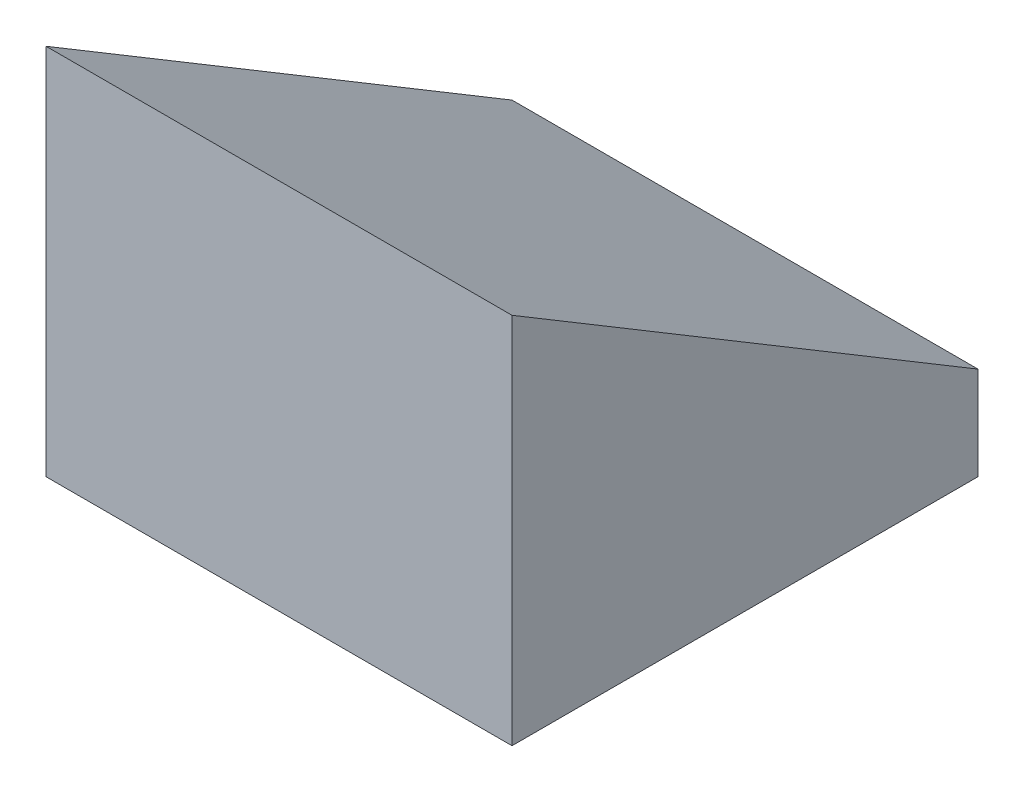
ISO-10303-21;
HEADER;
FILE_DESCRIPTION(('STEP AP214'),'2;1');
FILE_NAME('part.step','',(''),(''),'','','');
FILE_SCHEMA(('AUTOMOTIVE_DESIGN { 1 0 10303 214 1 1 1 1 }'));
ENDSEC;
DATA;
#1=APPLICATION_CONTEXT('core data for automotive mechanical design processes');
#2=APPLICATION_PROTOCOL_DEFINITION('international standard','automotive_design',2000,#1);
#3=PRODUCT_CONTEXT('',#1,'mechanical');
#4=PRODUCT('Part','Part','',(#3));
#5=PRODUCT_RELATED_PRODUCT_CATEGORY('part','',(#4));
#6=PRODUCT_DEFINITION_FORMATION('','',#4);
#7=PRODUCT_DEFINITION_CONTEXT('part definition',#1,'design');
#8=PRODUCT_DEFINITION('design','',#6,#7);
#9=PRODUCT_DEFINITION_SHAPE('','',#8);
#10=(LENGTH_UNIT() NAMED_UNIT(*) SI_UNIT(.MILLI.,.METRE.));
#11=(NAMED_UNIT(*) PLANE_ANGLE_UNIT() SI_UNIT($,.RADIAN.));
#12=(NAMED_UNIT(*) SI_UNIT($,.STERADIAN.) SOLID_ANGLE_UNIT());
#13=UNCERTAINTY_MEASURE_WITH_UNIT(LENGTH_MEASURE(1.E-05),#10,'distance_accuracy_value','');
#14=(GEOMETRIC_REPRESENTATION_CONTEXT(3) GLOBAL_UNCERTAINTY_ASSIGNED_CONTEXT((#13)) GLOBAL_UNIT_ASSIGNED_CONTEXT((#10,
#11,#12)) REPRESENTATION_CONTEXT('',''));
#15=CARTESIAN_POINT('',(0.,0.,0.));
#16=DIRECTION('',(0.,0.,1.));
#17=DIRECTION('',(1.,0.,0.));
#18=AXIS2_PLACEMENT_3D('',#15,#16,#17);
#19=CARTESIAN_POINT('',(5.,0.,0.));
#20=DIRECTION('',(0.,1.,0.));
#21=DIRECTION('',(0.,0.,1.));
#22=AXIS2_PLACEMENT_3D('',#19,#20,#21);
#23=PLANE('',#22);
#24=DIRECTION('',(0.,0.,-1.));
#25=VECTOR('',#24,1.);
#26=CARTESIAN_POINT('',(0.,0.,0.));
#27=LINE('',#26,#25);
#28=CARTESIAN_POINT('',(0.,0.,0.));
#29=VERTEX_POINT('',#28);
#30=CARTESIAN_POINT('',(0.,0.,-5.));
#31=VERTEX_POINT('',#30);
#32=EDGE_CURVE('E116',#29,#31,#27,.T.);
#33=ORIENTED_EDGE('',*,*,#32,.T.);
#34=DIRECTION('',(-1.,0.,0.));
#35=VECTOR('',#34,1.);
#36=CARTESIAN_POINT('',(5.,0.,-5.));
#37=LINE('',#36,#35);
#38=CARTESIAN_POINT('',(5.,0.,-5.));
#39=VERTEX_POINT('',#38);
#40=EDGE_CURVE('E11',#39,#31,#37,.T.);
#41=ORIENTED_EDGE('',*,*,#40,.F.);
#42=DIRECTION('',(0.,0.,-1.));
#43=VECTOR('',#42,1.);
#44=CARTESIAN_POINT('',(5.,0.,0.));
#45=LINE('',#44,#43);
#46=CARTESIAN_POINT('',(5.,0.,0.));
#47=VERTEX_POINT('',#46);
#48=EDGE_CURVE('E125',#47,#39,#45,.T.);
#49=ORIENTED_EDGE('',*,*,#48,.F.);
#50=DIRECTION('',(-1.,0.,0.));
#51=VECTOR('',#50,1.);
#52=CARTESIAN_POINT('',(5.,0.,0.));
#53=LINE('',#52,#51);
#54=EDGE_CURVE('E135',#47,#29,#53,.T.);
#55=ORIENTED_EDGE('',*,*,#54,.T.);
#56=EDGE_LOOP('',(#33,#41,#49,#55));
#57=FACE_BOUND('',#56,.T.);
#58=DIRECTION('',(-1.,0.,0.));
#59=VECTOR('',#58,1.);
#60=CARTESIAN_POINT('',(4.,0.,-4.));
#61=LINE('',#60,#59);
#62=CARTESIAN_POINT('',(4.,0.,-4.));
#63=VERTEX_POINT('',#62);
#64=CARTESIAN_POINT('',(1.,0.,-4.));
#65=VERTEX_POINT('',#64);
#66=EDGE_CURVE('E112',#63,#65,#61,.T.);
#67=ORIENTED_EDGE('',*,*,#66,.T.);
#68=DIRECTION('',(0.,0.,-1.));
#69=VECTOR('',#68,1.);
#70=CARTESIAN_POINT('',(1.,0.,0.));
#71=LINE('',#70,#69);
#72=CARTESIAN_POINT('',(1.,0.,-1.));
#73=VERTEX_POINT('',#72);
#74=EDGE_CURVE('E113',#73,#65,#71,.T.);
#75=ORIENTED_EDGE('',*,*,#74,.F.);
#76=DIRECTION('',(-1.,0.,0.));
#77=VECTOR('',#76,1.);
#78=CARTESIAN_POINT('',(4.,0.,-1.));
#79=LINE('',#78,#77);
#80=CARTESIAN_POINT('',(4.,0.,-1.));
#81=VERTEX_POINT('',#80);
#82=EDGE_CURVE('E121',#81,#73,#79,.T.);
#83=ORIENTED_EDGE('',*,*,#82,.F.);
#84=DIRECTION('',(0.,0.,-1.));
#85=VECTOR('',#84,1.);
#86=CARTESIAN_POINT('',(4.,0.,0.));
#87=LINE('',#86,#85);
#88=EDGE_CURVE('E173',#81,#63,#87,.T.);
#89=ORIENTED_EDGE('',*,*,#88,.T.);
#90=EDGE_LOOP('',(#67,#75,#83,#89));
#91=FACE_BOUND('',#90,.T.);
#92=ADVANCED_FACE('F35',(#57,#91),#23,.F.);
#93=CARTESIAN_POINT('',(0.,0.,0.));
#94=DIRECTION('',(1.,0.,0.));
#95=DIRECTION('',(0.,0.,-1.));
#96=AXIS2_PLACEMENT_3D('',#93,#94,#95);
#97=PLANE('',#96);
#98=DIRECTION('',(0.,1.,0.));
#99=VECTOR('',#98,1.);
#100=CARTESIAN_POINT('',(0.,0.,-5.));
#101=LINE('',#100,#99);
#102=CARTESIAN_POINT('',(0.,1.,-5.));
#103=VERTEX_POINT('',#102);
#104=EDGE_CURVE('E119',#31,#103,#101,.T.);
#105=ORIENTED_EDGE('',*,*,#104,.F.);
#106=ORIENTED_EDGE('',*,*,#32,.F.);
#107=DIRECTION('',(0.,1.,0.));
#108=VECTOR('',#107,1.);
#109=CARTESIAN_POINT('',(0.,0.,0.));
#110=LINE('',#109,#108);
#111=CARTESIAN_POINT('',(0.,4.,0.));
#112=VERTEX_POINT('',#111);
#113=EDGE_CURVE('E129',#29,#112,#110,.T.);
#114=ORIENTED_EDGE('',*,*,#113,.T.);
#115=DIRECTION('',(0.,0.514495755427526,0.857492925712544));
#116=VECTOR('',#115,1.);
#117=CARTESIAN_POINT('',(0.,2.94117647058824,-1.76470588235294));
#118=LINE('',#117,#116);
#119=EDGE_CURVE('E138',#103,#112,#118,.T.);
#120=ORIENTED_EDGE('',*,*,#119,.F.);
#121=EDGE_LOOP('',(#105,#106,#114,#120));
#122=FACE_BOUND('',#121,.T.);
#123=ADVANCED_FACE('F155',(#122),#97,.F.);
#124=CARTESIAN_POINT('',(5.,0.,-5.));
#125=DIRECTION('',(0.,0.,1.));
#126=DIRECTION('',(1.,0.,0.));
#127=AXIS2_PLACEMENT_3D('',#124,#125,#126);
#128=PLANE('',#127);
#129=ORIENTED_EDGE('',*,*,#104,.T.);
#130=DIRECTION('',(-1.,0.,0.));
#131=VECTOR('',#130,1.);
#132=CARTESIAN_POINT('',(5.,1.,-5.));
#133=LINE('',#132,#131);
#134=CARTESIAN_POINT('',(5.,1.,-5.));
#135=VERTEX_POINT('',#134);
#136=EDGE_CURVE('E42',#135,#103,#133,.T.);
#137=ORIENTED_EDGE('',*,*,#136,.F.);
#138=DIRECTION('',(0.,1.,0.));
#139=VECTOR('',#138,1.);
#140=CARTESIAN_POINT('',(5.,0.,-5.));
#141=LINE('',#140,#139);
#142=EDGE_CURVE('E128',#39,#135,#141,.T.);
#143=ORIENTED_EDGE('',*,*,#142,.F.);
#144=ORIENTED_EDGE('',*,*,#40,.T.);
#145=EDGE_LOOP('',(#129,#137,#143,#144));
#146=FACE_BOUND('',#145,.T.);
#147=ADVANCED_FACE('F165',(#146),#128,.F.);
#148=CARTESIAN_POINT('',(5.,2.94117647058824,-1.76470588235294));
#149=DIRECTION('',(0.,-0.857492925712544,0.514495755427526));
#150=DIRECTION('',(0.,-0.514495755427526,-0.857492925712544));
#151=AXIS2_PLACEMENT_3D('',#148,#149,#150);
#152=PLANE('',#151);
#153=ORIENTED_EDGE('',*,*,#119,.T.);
#154=DIRECTION('',(-1.,0.,0.));
#155=VECTOR('',#154,1.);
#156=CARTESIAN_POINT('',(5.,4.,0.));
#157=LINE('',#156,#155);
#158=CARTESIAN_POINT('',(5.,4.,0.));
#159=VERTEX_POINT('',#158);
#160=EDGE_CURVE('E144',#159,#112,#157,.T.);
#161=ORIENTED_EDGE('',*,*,#160,.F.);
#162=DIRECTION('',(0.,0.514495755427526,0.857492925712544));
#163=VECTOR('',#162,1.);
#164=CARTESIAN_POINT('',(5.,2.94117647058824,-1.76470588235294));
#165=LINE('',#164,#163);
#166=EDGE_CURVE('E131',#135,#159,#165,.T.);
#167=ORIENTED_EDGE('',*,*,#166,.F.);
#168=ORIENTED_EDGE('',*,*,#136,.T.);
#169=EDGE_LOOP('',(#153,#161,#167,#168));
#170=FACE_BOUND('',#169,.T.);
#171=ADVANCED_FACE('F150',(#170),#152,.F.);
#172=CARTESIAN_POINT('',(5.,0.,0.));
#173=DIRECTION('',(0.,0.,1.));
#174=DIRECTION('',(1.,0.,0.));
#175=AXIS2_PLACEMENT_3D('',#172,#173,#174);
#176=PLANE('',#175);
#177=ORIENTED_EDGE('',*,*,#113,.F.);
#178=ORIENTED_EDGE('',*,*,#54,.F.);
#179=DIRECTION('',(0.,1.,0.));
#180=VECTOR('',#179,1.);
#181=CARTESIAN_POINT('',(5.,0.,0.));
#182=LINE('',#181,#180);
#183=EDGE_CURVE('E133',#47,#159,#182,.T.);
#184=ORIENTED_EDGE('',*,*,#183,.T.);
#185=ORIENTED_EDGE('',*,*,#160,.T.);
#186=EDGE_LOOP('',(#177,#178,#184,#185));
#187=FACE_BOUND('',#186,.T.);
#188=ADVANCED_FACE('F159',(#187),#176,.T.);
#189=CARTESIAN_POINT('',(5.,0.,0.));
#190=DIRECTION('',(1.,0.,0.));
#191=DIRECTION('',(0.,0.,-1.));
#192=AXIS2_PLACEMENT_3D('',#189,#190,#191);
#193=PLANE('',#192);
#194=ORIENTED_EDGE('',*,*,#48,.T.);
#195=ORIENTED_EDGE('',*,*,#142,.T.);
#196=ORIENTED_EDGE('',*,*,#166,.T.);
#197=ORIENTED_EDGE('',*,*,#183,.F.);
#198=EDGE_LOOP('',(#194,#195,#196,#197));
#199=FACE_BOUND('',#198,.T.);
#200=ADVANCED_FACE('F163',(#199),#193,.T.);
#201=CARTESIAN_POINT('',(4.,0.,-4.));
#202=DIRECTION('',(0.,0.,1.));
#203=DIRECTION('',(1.,0.,0.));
#204=AXIS2_PLACEMENT_3D('',#201,#202,#203);
#205=PLANE('',#204);
#206=DIRECTION('',(0.,1.,0.));
#207=VECTOR('',#206,1.);
#208=CARTESIAN_POINT('',(1.,0.,-4.));
#209=LINE('',#208,#207);
#210=CARTESIAN_POINT('',(1.,1.,-4.));
#211=VERTEX_POINT('',#210);
#212=EDGE_CURVE('E49',#65,#211,#209,.T.);
#213=ORIENTED_EDGE('',*,*,#212,.F.);
#214=ORIENTED_EDGE('',*,*,#66,.F.);
#215=DIRECTION('',(0.,1.,0.));
#216=VECTOR('',#215,1.);
#217=CARTESIAN_POINT('',(4.,0.,-4.));
#218=LINE('',#217,#216);
#219=CARTESIAN_POINT('',(4.,1.,-4.));
#220=VERTEX_POINT('',#219);
#221=EDGE_CURVE('E104',#63,#220,#218,.T.);
#222=ORIENTED_EDGE('',*,*,#221,.T.);
#223=DIRECTION('',(-1.,0.,0.));
#224=VECTOR('',#223,1.);
#225=CARTESIAN_POINT('',(4.,1.,-4.));
#226=LINE('',#225,#224);
#227=EDGE_CURVE('E111',#220,#211,#226,.T.);
#228=ORIENTED_EDGE('',*,*,#227,.T.);
#229=EDGE_LOOP('',(#213,#214,#222,#228));
#230=FACE_BOUND('',#229,.T.);
#231=ADVANCED_FACE('F110',(#230),#205,.T.);
#232=CARTESIAN_POINT('',(4.,2.5,-1.5));
#233=DIRECTION('',(0.,-0.857492925712544,0.514495755427527));
#234=DIRECTION('',(0.,-0.514495755427527,-0.857492925712544));
#235=AXIS2_PLACEMENT_3D('',#232,#233,#234);
#236=PLANE('',#235);
#237=DIRECTION('',(0.,0.514495755427527,0.857492925712544));
#238=VECTOR('',#237,1.);
#239=CARTESIAN_POINT('',(1.,2.5,-1.5));
#240=LINE('',#239,#238);
#241=CARTESIAN_POINT('',(1.,2.8,-1.));
#242=VERTEX_POINT('',#241);
#243=EDGE_CURVE('E57',#211,#242,#240,.T.);
#244=ORIENTED_EDGE('',*,*,#243,.F.);
#245=ORIENTED_EDGE('',*,*,#227,.F.);
#246=DIRECTION('',(0.,0.514495755427527,0.857492925712544));
#247=VECTOR('',#246,1.);
#248=CARTESIAN_POINT('',(4.,2.5,-1.5));
#249=LINE('',#248,#247);
#250=CARTESIAN_POINT('',(4.,2.8,-1.));
#251=VERTEX_POINT('',#250);
#252=EDGE_CURVE('E101',#220,#251,#249,.T.);
#253=ORIENTED_EDGE('',*,*,#252,.T.);
#254=DIRECTION('',(-1.,0.,0.));
#255=VECTOR('',#254,1.);
#256=CARTESIAN_POINT('',(4.,2.8,-1.));
#257=LINE('',#256,#255);
#258=EDGE_CURVE('E117',#251,#242,#257,.T.);
#259=ORIENTED_EDGE('',*,*,#258,.T.);
#260=EDGE_LOOP('',(#244,#245,#253,#259));
#261=FACE_BOUND('',#260,.T.);
#262=ADVANCED_FACE('F115',(#261),#236,.T.);
#263=CARTESIAN_POINT('',(4.,0.,-1.));
#264=DIRECTION('',(0.,0.,1.));
#265=DIRECTION('',(1.,0.,0.));
#266=AXIS2_PLACEMENT_3D('',#263,#264,#265);
#267=PLANE('',#266);
#268=ORIENTED_EDGE('',*,*,#82,.T.);
#269=DIRECTION('',(0.,1.,0.));
#270=VECTOR('',#269,1.);
#271=CARTESIAN_POINT('',(1.,0.,-1.));
#272=LINE('',#271,#270);
#273=EDGE_CURVE('E177',#73,#242,#272,.T.);
#274=ORIENTED_EDGE('',*,*,#273,.T.);
#275=ORIENTED_EDGE('',*,*,#258,.F.);
#276=DIRECTION('',(0.,1.,0.));
#277=VECTOR('',#276,1.);
#278=CARTESIAN_POINT('',(4.,0.,-1.));
#279=LINE('',#278,#277);
#280=EDGE_CURVE('E107',#81,#251,#279,.T.);
#281=ORIENTED_EDGE('',*,*,#280,.F.);
#282=EDGE_LOOP('',(#268,#274,#275,#281));
#283=FACE_BOUND('',#282,.T.);
#284=ADVANCED_FACE('F184',(#283),#267,.F.);
#285=CARTESIAN_POINT('',(4.,0.,0.));
#286=DIRECTION('',(1.,0.,0.));
#287=DIRECTION('',(0.,0.,-1.));
#288=AXIS2_PLACEMENT_3D('',#285,#286,#287);
#289=PLANE('',#288);
#290=ORIENTED_EDGE('',*,*,#221,.F.);
#291=ORIENTED_EDGE('',*,*,#88,.F.);
#292=ORIENTED_EDGE('',*,*,#280,.T.);
#293=ORIENTED_EDGE('',*,*,#252,.F.);
#294=EDGE_LOOP('',(#290,#291,#292,#293));
#295=FACE_BOUND('',#294,.T.);
#296=ADVANCED_FACE('F103',(#295),#289,.F.);
#297=CARTESIAN_POINT('',(1.,0.,0.));
#298=DIRECTION('',(1.,0.,0.));
#299=DIRECTION('',(0.,0.,-1.));
#300=AXIS2_PLACEMENT_3D('',#297,#298,#299);
#301=PLANE('',#300);
#302=ORIENTED_EDGE('',*,*,#212,.T.);
#303=ORIENTED_EDGE('',*,*,#243,.T.);
#304=ORIENTED_EDGE('',*,*,#273,.F.);
#305=ORIENTED_EDGE('',*,*,#74,.T.);
#306=EDGE_LOOP('',(#302,#303,#304,#305));
#307=FACE_BOUND('',#306,.T.);
#308=ADVANCED_FACE('F176',(#307),#301,.T.);
#309=CLOSED_SHELL('',(#92,#123,#147,#171,#188,#200,#231,#262,#284,#296,#308));
#310=MANIFOLD_SOLID_BREP('B2',#309);
#311=ADVANCED_BREP_SHAPE_REPRESENTATION('',(#18,#310),#14);
#312=SHAPE_DEFINITION_REPRESENTATION(#9,#311);
ENDSEC;
END-ISO-10303-21;
